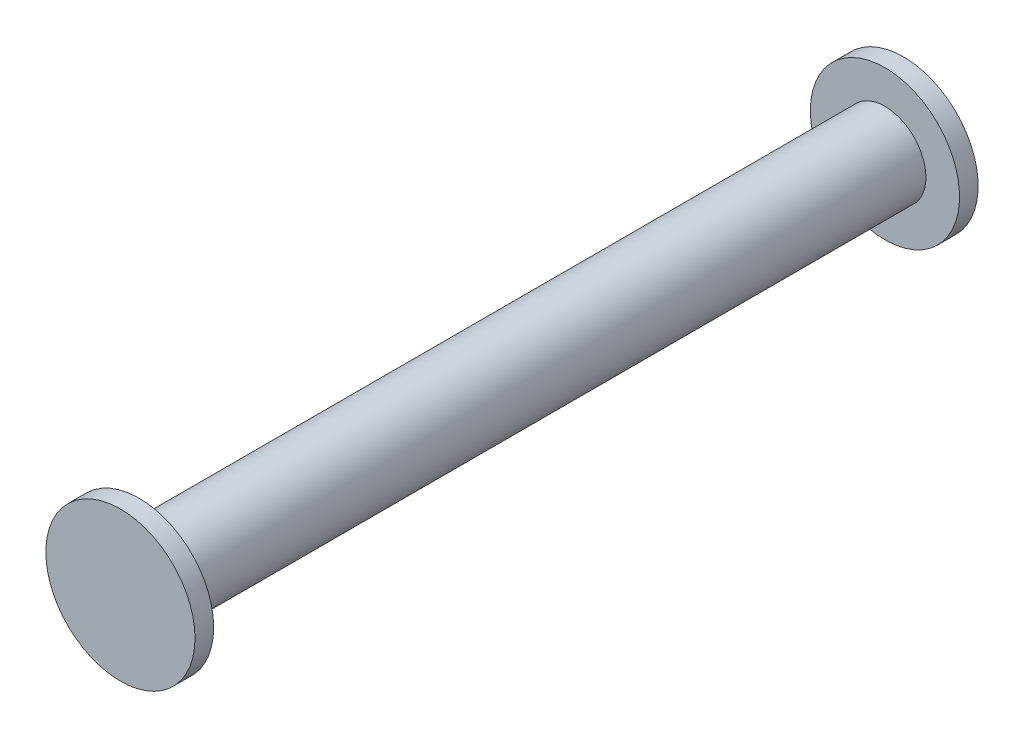
ISO-10303-21;
HEADER;
FILE_DESCRIPTION(('STEP AP214'),'2;1');
FILE_NAME('part.step','',(''),(''),'','','');
FILE_SCHEMA(('AUTOMOTIVE_DESIGN { 1 0 10303 214 1 1 1 1 }'));
ENDSEC;
DATA;
#1=APPLICATION_CONTEXT('core data for automotive mechanical design processes');
#2=APPLICATION_PROTOCOL_DEFINITION('international standard','automotive_design',2000,#1);
#3=PRODUCT_CONTEXT('',#1,'mechanical');
#4=PRODUCT('Part','Part','',(#3));
#5=PRODUCT_RELATED_PRODUCT_CATEGORY('part','',(#4));
#6=PRODUCT_DEFINITION_FORMATION('','',#4);
#7=PRODUCT_DEFINITION_CONTEXT('part definition',#1,'design');
#8=PRODUCT_DEFINITION('design','',#6,#7);
#9=PRODUCT_DEFINITION_SHAPE('','',#8);
#10=(LENGTH_UNIT() NAMED_UNIT(*) SI_UNIT(.MILLI.,.METRE.));
#11=(NAMED_UNIT(*) PLANE_ANGLE_UNIT() SI_UNIT($,.RADIAN.));
#12=(NAMED_UNIT(*) SI_UNIT($,.STERADIAN.) SOLID_ANGLE_UNIT());
#13=UNCERTAINTY_MEASURE_WITH_UNIT(LENGTH_MEASURE(1.E-05),#10,'distance_accuracy_value','');
#14=(GEOMETRIC_REPRESENTATION_CONTEXT(3) GLOBAL_UNCERTAINTY_ASSIGNED_CONTEXT((#13)) GLOBAL_UNIT_ASSIGNED_CONTEXT((#10,
#11,#12)) REPRESENTATION_CONTEXT('',''));
#15=CARTESIAN_POINT('',(0.,0.,0.));
#16=DIRECTION('',(0.,0.,1.));
#17=DIRECTION('',(1.,0.,0.));
#18=AXIS2_PLACEMENT_3D('',#15,#16,#17);
#19=CARTESIAN_POINT('',(-44.111688033515,4.88830188679246,-40.));
#20=DIRECTION('',(0.,0.,1.));
#21=DIRECTION('',(1.,0.,0.));
#22=AXIS2_PLACEMENT_3D('',#19,#20,#21);
#23=CYLINDRICAL_SURFACE('',#22,2.2);
#24=CARTESIAN_POINT('',(-44.111688033515,4.88830188679246,-40.));
#25=DIRECTION('',(0.,0.,-1.));
#26=DIRECTION('',(-1.,0.,0.));
#27=AXIS2_PLACEMENT_3D('',#24,#25,#26);
#28=CIRCLE('',#27,2.2);
#29=CARTESIAN_POINT('',(-46.311688033515,4.88830188679246,-40.));
#30=VERTEX_POINT('',#29);
#31=EDGE_CURVE('E46',#30,#30,#28,.F.);
#32=ORIENTED_EDGE('',*,*,#31,.T.);
#33=EDGE_LOOP('',(#32));
#34=FACE_BOUND('',#33,.T.);
#35=CARTESIAN_POINT('',(-44.111688033515,4.88830188679246,0.));
#36=DIRECTION('',(0.,0.,1.));
#37=DIRECTION('',(1.,0.,0.));
#38=AXIS2_PLACEMENT_3D('',#35,#36,#37);
#39=CIRCLE('',#38,2.2);
#40=CARTESIAN_POINT('',(-41.911688033515,4.88830188679246,0.));
#41=VERTEX_POINT('',#40);
#42=EDGE_CURVE('E10',#41,#41,#39,.T.);
#43=ORIENTED_EDGE('',*,*,#42,.F.);
#44=EDGE_LOOP('',(#43));
#45=FACE_BOUND('',#44,.T.);
#46=ADVANCED_FACE('F31',(#34,#45),#23,.T.);
#47=CARTESIAN_POINT('',(-44.111688033515,4.88830188679246,1.));
#48=DIRECTION('',(0.,0.,-1.));
#49=DIRECTION('',(-1.,0.,0.));
#50=AXIS2_PLACEMENT_3D('',#47,#48,#49);
#51=CYLINDRICAL_SURFACE('',#50,4.00000000000001);
#52=CARTESIAN_POINT('',(-44.111688033515,4.88830188679246,1.));
#53=DIRECTION('',(0.,0.,1.));
#54=DIRECTION('',(1.,0.,0.));
#55=AXIS2_PLACEMENT_3D('',#52,#53,#54);
#56=CIRCLE('',#55,4.00000000000001);
#57=CARTESIAN_POINT('',(-40.111688033515,4.88830188679246,1.));
#58=VERTEX_POINT('',#57);
#59=EDGE_CURVE('E37',#58,#58,#56,.T.);
#60=ORIENTED_EDGE('',*,*,#59,.F.);
#61=EDGE_LOOP('',(#60));
#62=FACE_BOUND('',#61,.T.);
#63=CARTESIAN_POINT('',(-44.111688033515,4.88830188679246,0.));
#64=DIRECTION('',(0.,0.,1.));
#65=DIRECTION('',(1.,0.,0.));
#66=AXIS2_PLACEMENT_3D('',#63,#64,#65);
#67=CIRCLE('',#66,4.00000000000001);
#68=CARTESIAN_POINT('',(-40.111688033515,4.88830188679246,0.));
#69=VERTEX_POINT('',#68);
#70=EDGE_CURVE('E41',#69,#69,#67,.T.);
#71=ORIENTED_EDGE('',*,*,#70,.T.);
#72=EDGE_LOOP('',(#71));
#73=FACE_BOUND('',#72,.T.);
#74=ADVANCED_FACE('F76',(#62,#73),#51,.T.);
#75=CARTESIAN_POINT('',(-44.111688033515,4.88830188679246,1.));
#76=DIRECTION('',(0.,0.,1.));
#77=DIRECTION('',(1.,0.,0.));
#78=AXIS2_PLACEMENT_3D('',#75,#76,#77);
#79=PLANE('',#78);
#80=ORIENTED_EDGE('',*,*,#59,.T.);
#81=EDGE_LOOP('',(#80));
#82=FACE_BOUND('',#81,.T.);
#83=ADVANCED_FACE('F81',(#82),#79,.T.);
#84=CARTESIAN_POINT('',(-44.111688033515,4.88830188679246,0.));
#85=DIRECTION('',(0.,0.,1.));
#86=DIRECTION('',(1.,0.,0.));
#87=AXIS2_PLACEMENT_3D('',#84,#85,#86);
#88=PLANE('',#87);
#89=ORIENTED_EDGE('',*,*,#42,.T.);
#90=EDGE_LOOP('',(#89));
#91=FACE_BOUND('',#90,.T.);
#92=ORIENTED_EDGE('',*,*,#70,.F.);
#93=EDGE_LOOP('',(#92));
#94=FACE_BOUND('',#93,.T.);
#95=ADVANCED_FACE('F62',(#91,#94),#88,.F.);
#96=CARTESIAN_POINT('',(-44.111688033515,4.88830188679246,-41.));
#97=DIRECTION('',(0.,0.,1.));
#98=DIRECTION('',(1.,0.,0.));
#99=AXIS2_PLACEMENT_3D('',#96,#97,#98);
#100=CYLINDRICAL_SURFACE('',#99,4.00000000000001);
#101=CARTESIAN_POINT('',(-44.111688033515,4.88830188679246,-41.));
#102=DIRECTION('',(0.,0.,-1.));
#103=DIRECTION('',(-1.,0.,0.));
#104=AXIS2_PLACEMENT_3D('',#101,#102,#103);
#105=CIRCLE('',#104,4.00000000000001);
#106=CARTESIAN_POINT('',(-48.111688033515,4.88830188679246,-41.));
#107=VERTEX_POINT('',#106);
#108=EDGE_CURVE('E50',#107,#107,#105,.T.);
#109=ORIENTED_EDGE('',*,*,#108,.F.);
#110=EDGE_LOOP('',(#109));
#111=FACE_BOUND('',#110,.T.);
#112=CARTESIAN_POINT('',(-44.111688033515,4.88830188679246,-40.));
#113=DIRECTION('',(0.,0.,-1.));
#114=DIRECTION('',(-1.,0.,0.));
#115=AXIS2_PLACEMENT_3D('',#112,#113,#114);
#116=CIRCLE('',#115,4.00000000000001);
#117=CARTESIAN_POINT('',(-48.111688033515,4.88830188679246,-40.));
#118=VERTEX_POINT('',#117);
#119=EDGE_CURVE('E51',#118,#118,#116,.T.);
#120=ORIENTED_EDGE('',*,*,#119,.T.);
#121=EDGE_LOOP('',(#120));
#122=FACE_BOUND('',#121,.T.);
#123=ADVANCED_FACE('F59',(#111,#122),#100,.T.);
#124=CARTESIAN_POINT('',(-44.111688033515,4.88830188679246,-41.));
#125=DIRECTION('',(0.,0.,-1.));
#126=DIRECTION('',(-1.,0.,0.));
#127=AXIS2_PLACEMENT_3D('',#124,#125,#126);
#128=PLANE('',#127);
#129=ORIENTED_EDGE('',*,*,#108,.T.);
#130=EDGE_LOOP('',(#129));
#131=FACE_BOUND('',#130,.T.);
#132=ADVANCED_FACE('F57',(#131),#128,.T.);
#133=CARTESIAN_POINT('',(-44.111688033515,4.88830188679246,-40.));
#134=DIRECTION('',(0.,0.,-1.));
#135=DIRECTION('',(-1.,0.,0.));
#136=AXIS2_PLACEMENT_3D('',#133,#134,#135);
#137=PLANE('',#136);
#138=ORIENTED_EDGE('',*,*,#31,.F.);
#139=EDGE_LOOP('',(#138));
#140=FACE_BOUND('',#139,.T.);
#141=ORIENTED_EDGE('',*,*,#119,.F.);
#142=EDGE_LOOP('',(#141));
#143=FACE_BOUND('',#142,.T.);
#144=ADVANCED_FACE('F66',(#140,#143),#137,.F.);
#145=CLOSED_SHELL('',(#46,#74,#83,#95,#123,#132,#144));
#146=MANIFOLD_SOLID_BREP('B2',#145);
#147=ADVANCED_BREP_SHAPE_REPRESENTATION('',(#18,#146),#14);
#148=SHAPE_DEFINITION_REPRESENTATION(#9,#147);
ENDSEC;
END-ISO-10303-21;
